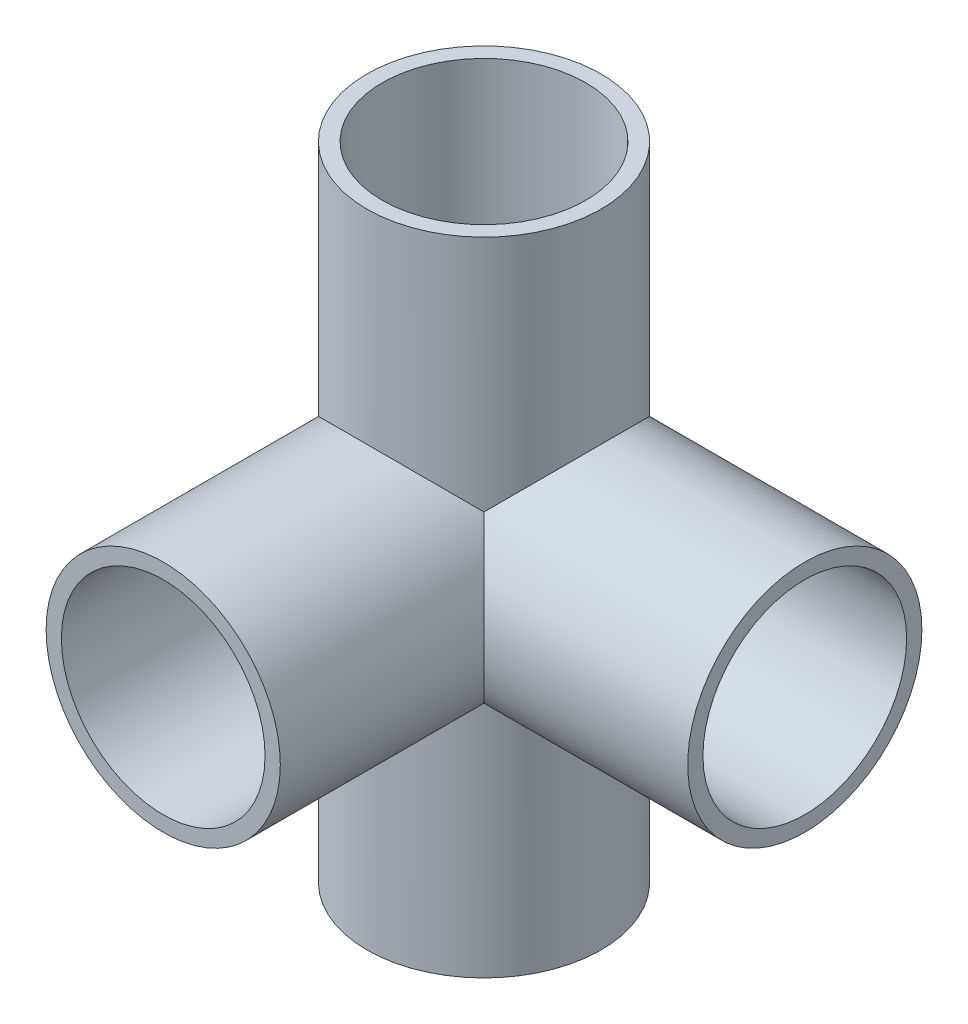
ISO-10303-21;
HEADER;
FILE_DESCRIPTION(('STEP AP214'),'2;1');
FILE_NAME('part.step','',(''),(''),'','','');
FILE_SCHEMA(('AUTOMOTIVE_DESIGN { 1 0 10303 214 1 1 1 1 }'));
ENDSEC;
DATA;
#1=APPLICATION_CONTEXT('core data for automotive mechanical design processes');
#2=APPLICATION_PROTOCOL_DEFINITION('international standard','automotive_design',2000,#1);
#3=PRODUCT_CONTEXT('',#1,'mechanical');
#4=PRODUCT('Part','Part','',(#3));
#5=PRODUCT_RELATED_PRODUCT_CATEGORY('part','',(#4));
#6=PRODUCT_DEFINITION_FORMATION('','',#4);
#7=PRODUCT_DEFINITION_CONTEXT('part definition',#1,'design');
#8=PRODUCT_DEFINITION('design','',#6,#7);
#9=PRODUCT_DEFINITION_SHAPE('','',#8);
#10=(LENGTH_UNIT() NAMED_UNIT(*) SI_UNIT(.MILLI.,.METRE.));
#11=(NAMED_UNIT(*) PLANE_ANGLE_UNIT() SI_UNIT($,.RADIAN.));
#12=(NAMED_UNIT(*) SI_UNIT($,.STERADIAN.) SOLID_ANGLE_UNIT());
#13=UNCERTAINTY_MEASURE_WITH_UNIT(LENGTH_MEASURE(1.E-05),#10,'distance_accuracy_value','');
#14=(GEOMETRIC_REPRESENTATION_CONTEXT(3) GLOBAL_UNCERTAINTY_ASSIGNED_CONTEXT((#13)) GLOBAL_UNIT_ASSIGNED_CONTEXT((#10,
#11,#12)) REPRESENTATION_CONTEXT('',''));
#15=CARTESIAN_POINT('',(0.,0.,0.));
#16=DIRECTION('',(0.,0.,1.));
#17=DIRECTION('',(1.,0.,0.));
#18=AXIS2_PLACEMENT_3D('',#15,#16,#17);
#19=CARTESIAN_POINT('',(0.,80.01,0.));
#20=DIRECTION('',(0.,-1.,0.));
#21=DIRECTION('',(0.,0.,-1.));
#22=AXIS2_PLACEMENT_3D('',#19,#20,#21);
#23=CYLINDRICAL_SURFACE('',#22,14.605);
#24=CARTESIAN_POINT('',(0.,80.01,0.));
#25=DIRECTION('',(0.,1.,0.));
#26=DIRECTION('',(0.,0.,1.));
#27=AXIS2_PLACEMENT_3D('',#24,#25,#26);
#28=CIRCLE('',#27,14.605);
#29=CARTESIAN_POINT('',(0.,80.01,14.605));
#30=VERTEX_POINT('',#29);
#31=EDGE_CURVE('E89',#30,#30,#28,.T.);
#32=ORIENTED_EDGE('',*,*,#31,.F.);
#33=EDGE_LOOP('',(#32));
#34=FACE_BOUND('',#33,.T.);
#35=CARTESIAN_POINT('',(0.,0.,0.));
#36=DIRECTION('',(0.,1.,0.));
#37=DIRECTION('',(0.,0.,1.));
#38=AXIS2_PLACEMENT_3D('',#35,#36,#37);
#39=CIRCLE('',#38,14.605);
#40=CARTESIAN_POINT('',(0.,0.,14.605));
#41=VERTEX_POINT('',#40);
#42=EDGE_CURVE('E92',#41,#41,#39,.T.);
#43=ORIENTED_EDGE('',*,*,#42,.T.);
#44=EDGE_LOOP('',(#43));
#45=FACE_BOUND('',#44,.T.);
#46=CARTESIAN_POINT('',(0.,40.005,0.));
#47=DIRECTION('',(-0.707106781186547,-0.707106781186547,0.));
#48=DIRECTION('',(0.707106781186547,-0.707106781186547,0.));
#49=AXIS2_PLACEMENT_3D('',#46,#47,#48);
#50=ELLIPSE('',#49,20.6545890784591,14.605);
#51=CARTESIAN_POINT('',(10.3272945392295,29.6777054607705,10.3272945392295));
#52=VERTEX_POINT('',#51);
#53=CARTESIAN_POINT('',(0.,40.005,-14.605));
#54=VERTEX_POINT('',#53);
#55=EDGE_CURVE('E121',#52,#54,#50,.F.);
#56=ORIENTED_EDGE('',*,*,#55,.F.);
#57=CARTESIAN_POINT('',(0.,40.005,0.));
#58=DIRECTION('',(0.,-0.707106781186547,-0.707106781186547));
#59=DIRECTION('',(0.,-0.707106781186547,0.707106781186547));
#60=AXIS2_PLACEMENT_3D('',#57,#58,#59);
#61=ELLIPSE('',#60,20.6545890784591,14.605);
#62=CARTESIAN_POINT('',(-14.605,40.005,0.));
#63=VERTEX_POINT('',#62);
#64=EDGE_CURVE('E104',#63,#52,#61,.F.);
#65=ORIENTED_EDGE('',*,*,#64,.F.);
#66=CARTESIAN_POINT('',(0.,40.005,0.));
#67=DIRECTION('',(0.,-0.707106781186547,0.707106781186547));
#68=DIRECTION('',(0.,-0.707106781186547,-0.707106781186547));
#69=AXIS2_PLACEMENT_3D('',#66,#67,#68);
#70=ELLIPSE('',#69,20.6545890784591,14.605);
#71=CARTESIAN_POINT('',(10.3272945392295,50.3322945392295,10.3272945392295));
#72=VERTEX_POINT('',#71);
#73=EDGE_CURVE('E110',#72,#63,#70,.T.);
#74=ORIENTED_EDGE('',*,*,#73,.F.);
#75=CARTESIAN_POINT('',(0.,40.005,0.));
#76=DIRECTION('',(0.707106781186547,-0.707106781186547,0.));
#77=DIRECTION('',(-0.707106781186547,-0.707106781186547,0.));
#78=AXIS2_PLACEMENT_3D('',#75,#76,#77);
#79=ELLIPSE('',#78,20.6545890784591,14.605);
#80=EDGE_CURVE('E125',#54,#72,#79,.T.);
#81=ORIENTED_EDGE('',*,*,#80,.F.);
#82=EDGE_LOOP('',(#56,#65,#74,#81));
#83=FACE_BOUND('',#82,.T.);
#84=ADVANCED_FACE('F39',(#34,#45,#83),#23,.T.);
#85=CARTESIAN_POINT('',(0.,80.01,0.));
#86=DIRECTION('',(0.,-1.,0.));
#87=DIRECTION('',(0.,0.,-1.));
#88=AXIS2_PLACEMENT_3D('',#85,#86,#87);
#89=CYLINDRICAL_SURFACE('',#88,12.7);
#90=CARTESIAN_POINT('',(0.,40.005,0.));
#91=DIRECTION('',(0.707106781186547,-0.707106781186547,0.));
#92=DIRECTION('',(0.707106781186547,0.707106781186547,0.));
#93=AXIS2_PLACEMENT_3D('',#90,#91,#92);
#94=ELLIPSE('',#93,17.9605122421384,12.7000000000001);
#95=CARTESIAN_POINT('',(8.98025612106918,48.9852561210692,8.9802561210692));
#96=VERTEX_POINT('',#95);
#97=CARTESIAN_POINT('',(0.,40.005,-12.7000000000001));
#98=VERTEX_POINT('',#97);
#99=EDGE_CURVE('E86',#96,#98,#94,.F.);
#100=ORIENTED_EDGE('',*,*,#99,.F.);
#101=CARTESIAN_POINT('',(0.,40.005,0.));
#102=DIRECTION('',(0.,-0.707106781186547,0.707106781186547));
#103=DIRECTION('',(0.,0.707106781186547,0.707106781186547));
#104=AXIS2_PLACEMENT_3D('',#101,#102,#103);
#105=ELLIPSE('',#104,17.9605122421384,12.7000000000001);
#106=CARTESIAN_POINT('',(-12.7000000000001,40.005,0.));
#107=VERTEX_POINT('',#106);
#108=EDGE_CURVE('E54',#107,#96,#105,.F.);
#109=ORIENTED_EDGE('',*,*,#108,.F.);
#110=CARTESIAN_POINT('',(0.,40.005,0.));
#111=DIRECTION('',(0.,0.707106781186547,0.707106781186547));
#112=DIRECTION('',(0.,-0.707106781186547,0.707106781186547));
#113=AXIS2_PLACEMENT_3D('',#110,#111,#112);
#114=ELLIPSE('',#113,17.9605122421384,12.7000000000001);
#115=CARTESIAN_POINT('',(8.98025612106915,31.0247438789308,8.98025612106915));
#116=VERTEX_POINT('',#115);
#117=EDGE_CURVE('E76',#116,#107,#114,.F.);
#118=ORIENTED_EDGE('',*,*,#117,.F.);
#119=CARTESIAN_POINT('',(0.,40.005,0.));
#120=DIRECTION('',(0.707106781186547,0.707106781186547,0.));
#121=DIRECTION('',(0.707106781186547,-0.707106781186547,0.));
#122=AXIS2_PLACEMENT_3D('',#119,#120,#121);
#123=ELLIPSE('',#122,17.9605122421384,12.7000000000001);
#124=EDGE_CURVE('E47',#98,#116,#123,.F.);
#125=ORIENTED_EDGE('',*,*,#124,.F.);
#126=EDGE_LOOP('',(#100,#109,#118,#125));
#127=FACE_BOUND('',#126,.T.);
#128=CARTESIAN_POINT('',(0.,80.01,0.));
#129=DIRECTION('',(0.,1.,0.));
#130=DIRECTION('',(0.,0.,1.));
#131=AXIS2_PLACEMENT_3D('',#128,#129,#130);
#132=CIRCLE('',#131,12.7);
#133=CARTESIAN_POINT('',(0.,80.01,12.7));
#134=VERTEX_POINT('',#133);
#135=EDGE_CURVE('E96',#134,#134,#132,.T.);
#136=ORIENTED_EDGE('',*,*,#135,.T.);
#137=EDGE_LOOP('',(#136));
#138=FACE_BOUND('',#137,.T.);
#139=CARTESIAN_POINT('',(0.,0.,0.));
#140=DIRECTION('',(0.,1.,0.));
#141=DIRECTION('',(0.,0.,1.));
#142=AXIS2_PLACEMENT_3D('',#139,#140,#141);
#143=CIRCLE('',#142,12.7);
#144=CARTESIAN_POINT('',(0.,0.,12.7));
#145=VERTEX_POINT('',#144);
#146=EDGE_CURVE('E100',#145,#145,#143,.T.);
#147=ORIENTED_EDGE('',*,*,#146,.F.);
#148=EDGE_LOOP('',(#147));
#149=FACE_BOUND('',#148,.T.);
#150=ADVANCED_FACE('F77',(#127,#138,#149),#89,.F.);
#151=CARTESIAN_POINT('',(0.,40.005,40.005));
#152=DIRECTION('',(0.,0.,-1.));
#153=DIRECTION('',(-1.,0.,0.));
#154=AXIS2_PLACEMENT_3D('',#151,#152,#153);
#155=CYLINDRICAL_SURFACE('',#154,14.605);
#156=CARTESIAN_POINT('',(0.,40.005,40.005));
#157=DIRECTION('',(0.,0.,1.));
#158=DIRECTION('',(1.,0.,0.));
#159=AXIS2_PLACEMENT_3D('',#156,#157,#158);
#160=CIRCLE('',#159,14.605);
#161=CARTESIAN_POINT('',(14.605,40.005,40.005));
#162=VERTEX_POINT('',#161);
#163=EDGE_CURVE('E113',#162,#162,#160,.T.);
#164=ORIENTED_EDGE('',*,*,#163,.F.);
#165=EDGE_LOOP('',(#164));
#166=FACE_BOUND('',#165,.T.);
#167=CARTESIAN_POINT('',(0.,40.005,0.));
#168=DIRECTION('',(0.707106781186547,0.,-0.707106781186547));
#169=DIRECTION('',(-0.707106781186547,0.,-0.707106781186547));
#170=AXIS2_PLACEMENT_3D('',#167,#168,#169);
#171=ELLIPSE('',#170,20.6545890784591,14.605);
#172=EDGE_CURVE('E129',#72,#52,#171,.T.);
#173=ORIENTED_EDGE('',*,*,#172,.F.);
#174=ORIENTED_EDGE('',*,*,#73,.T.);
#175=ORIENTED_EDGE('',*,*,#64,.T.);
#176=EDGE_LOOP('',(#173,#174,#175));
#177=FACE_BOUND('',#176,.T.);
#178=ADVANCED_FACE('F158',(#166,#177),#155,.T.);
#179=CARTESIAN_POINT('',(0.,40.005,-35.9210244842766));
#180=DIRECTION('',(0.,0.,1.));
#181=DIRECTION('',(1.,0.,0.));
#182=AXIS2_PLACEMENT_3D('',#179,#180,#181);
#183=CYLINDRICAL_SURFACE('',#182,12.7);
#184=CARTESIAN_POINT('',(0.,40.005,40.005));
#185=DIRECTION('',(0.,0.,1.));
#186=DIRECTION('',(1.,0.,0.));
#187=AXIS2_PLACEMENT_3D('',#184,#185,#186);
#188=CIRCLE('',#187,12.7);
#189=CARTESIAN_POINT('',(12.7,40.005,40.005));
#190=VERTEX_POINT('',#189);
#191=EDGE_CURVE('E117',#190,#190,#188,.T.);
#192=ORIENTED_EDGE('',*,*,#191,.T.);
#193=EDGE_LOOP('',(#192));
#194=FACE_BOUND('',#193,.T.);
#195=ORIENTED_EDGE('',*,*,#108,.T.);
#196=CARTESIAN_POINT('',(0.,40.005,0.));
#197=DIRECTION('',(0.707106781186547,0.,-0.707106781186547));
#198=DIRECTION('',(0.707106781186547,0.,0.707106781186547));
#199=AXIS2_PLACEMENT_3D('',#196,#197,#198);
#200=ELLIPSE('',#199,17.9605122421383,12.7);
#201=EDGE_CURVE('E11',#116,#96,#200,.F.);
#202=ORIENTED_EDGE('',*,*,#201,.F.);
#203=ORIENTED_EDGE('',*,*,#117,.T.);
#204=EDGE_LOOP('',(#195,#202,#203));
#205=FACE_BOUND('',#204,.T.);
#206=ADVANCED_FACE('F82',(#194,#205),#183,.F.);
#207=CARTESIAN_POINT('',(0.,80.01,0.));
#208=DIRECTION('',(0.,1.,0.));
#209=DIRECTION('',(0.,0.,1.));
#210=AXIS2_PLACEMENT_3D('',#207,#208,#209);
#211=PLANE('',#210);
#212=ORIENTED_EDGE('',*,*,#31,.T.);
#213=EDGE_LOOP('',(#212));
#214=FACE_BOUND('',#213,.T.);
#215=ORIENTED_EDGE('',*,*,#135,.F.);
#216=EDGE_LOOP('',(#215));
#217=FACE_BOUND('',#216,.T.);
#218=ADVANCED_FACE('F174',(#214,#217),#211,.T.);
#219=CARTESIAN_POINT('',(0.,0.,0.));
#220=DIRECTION('',(0.,1.,0.));
#221=DIRECTION('',(0.,0.,1.));
#222=AXIS2_PLACEMENT_3D('',#219,#220,#221);
#223=PLANE('',#222);
#224=ORIENTED_EDGE('',*,*,#42,.F.);
#225=EDGE_LOOP('',(#224));
#226=FACE_BOUND('',#225,.T.);
#227=ORIENTED_EDGE('',*,*,#146,.T.);
#228=EDGE_LOOP('',(#227));
#229=FACE_BOUND('',#228,.T.);
#230=ADVANCED_FACE('F171',(#226,#229),#223,.F.);
#231=CARTESIAN_POINT('',(0.,40.005,40.005));
#232=DIRECTION('',(0.,0.,1.));
#233=DIRECTION('',(1.,0.,0.));
#234=AXIS2_PLACEMENT_3D('',#231,#232,#233);
#235=PLANE('',#234);
#236=ORIENTED_EDGE('',*,*,#191,.F.);
#237=EDGE_LOOP('',(#236));
#238=FACE_BOUND('',#237,.T.);
#239=ORIENTED_EDGE('',*,*,#163,.T.);
#240=EDGE_LOOP('',(#239));
#241=FACE_BOUND('',#240,.T.);
#242=ADVANCED_FACE('F153',(#238,#241),#235,.T.);
#243=CARTESIAN_POINT('',(40.005,40.005,0.));
#244=DIRECTION('',(-1.,0.,0.));
#245=DIRECTION('',(0.,0.,1.));
#246=AXIS2_PLACEMENT_3D('',#243,#244,#245);
#247=CYLINDRICAL_SURFACE('',#246,14.605);
#248=CARTESIAN_POINT('',(40.005,40.005,0.));
#249=DIRECTION('',(1.,0.,0.));
#250=DIRECTION('',(0.,0.,-1.));
#251=AXIS2_PLACEMENT_3D('',#248,#249,#250);
#252=CIRCLE('',#251,14.605);
#253=CARTESIAN_POINT('',(40.005,40.005,-14.605));
#254=VERTEX_POINT('',#253);
#255=EDGE_CURVE('E133',#254,#254,#252,.T.);
#256=ORIENTED_EDGE('',*,*,#255,.F.);
#257=EDGE_LOOP('',(#256));
#258=FACE_BOUND('',#257,.T.);
#259=ORIENTED_EDGE('',*,*,#172,.T.);
#260=ORIENTED_EDGE('',*,*,#55,.T.);
#261=ORIENTED_EDGE('',*,*,#80,.T.);
#262=EDGE_LOOP('',(#259,#260,#261));
#263=FACE_BOUND('',#262,.T.);
#264=ADVANCED_FACE('F147',(#258,#263),#247,.T.);
#265=CARTESIAN_POINT('',(40.005,40.005,0.));
#266=DIRECTION('',(1.,0.,0.));
#267=DIRECTION('',(0.,0.,-1.));
#268=AXIS2_PLACEMENT_3D('',#265,#266,#267);
#269=PLANE('',#268);
#270=CARTESIAN_POINT('',(40.005,40.005,0.));
#271=DIRECTION('',(1.,0.,0.));
#272=DIRECTION('',(0.,0.,-1.));
#273=AXIS2_PLACEMENT_3D('',#270,#271,#272);
#274=CIRCLE('',#273,12.7);
#275=CARTESIAN_POINT('',(40.005,40.005,-12.7));
#276=VERTEX_POINT('',#275);
#277=EDGE_CURVE('E137',#276,#276,#274,.T.);
#278=ORIENTED_EDGE('',*,*,#277,.F.);
#279=EDGE_LOOP('',(#278));
#280=FACE_BOUND('',#279,.T.);
#281=ORIENTED_EDGE('',*,*,#255,.T.);
#282=EDGE_LOOP('',(#281));
#283=FACE_BOUND('',#282,.T.);
#284=ADVANCED_FACE('F144',(#280,#283),#269,.T.);
#285=CARTESIAN_POINT('',(0.,40.005,0.));
#286=DIRECTION('',(1.,0.,0.));
#287=DIRECTION('',(0.,0.,-1.));
#288=AXIS2_PLACEMENT_3D('',#285,#286,#287);
#289=CYLINDRICAL_SURFACE('',#288,12.7);
#290=ORIENTED_EDGE('',*,*,#124,.T.);
#291=ORIENTED_EDGE('',*,*,#201,.T.);
#292=ORIENTED_EDGE('',*,*,#99,.T.);
#293=EDGE_LOOP('',(#290,#291,#292));
#294=FACE_BOUND('',#293,.T.);
#295=ORIENTED_EDGE('',*,*,#277,.T.);
#296=EDGE_LOOP('',(#295));
#297=FACE_BOUND('',#296,.T.);
#298=ADVANCED_FACE('F84',(#294,#297),#289,.F.);
#299=CLOSED_SHELL('',(#84,#150,#178,#206,#218,#230,#242,#264,#284,#298));
#300=MANIFOLD_SOLID_BREP('B2',#299);
#301=ADVANCED_BREP_SHAPE_REPRESENTATION('',(#18,#300),#14);
#302=SHAPE_DEFINITION_REPRESENTATION(#9,#301);
ENDSEC;
END-ISO-10303-21;
